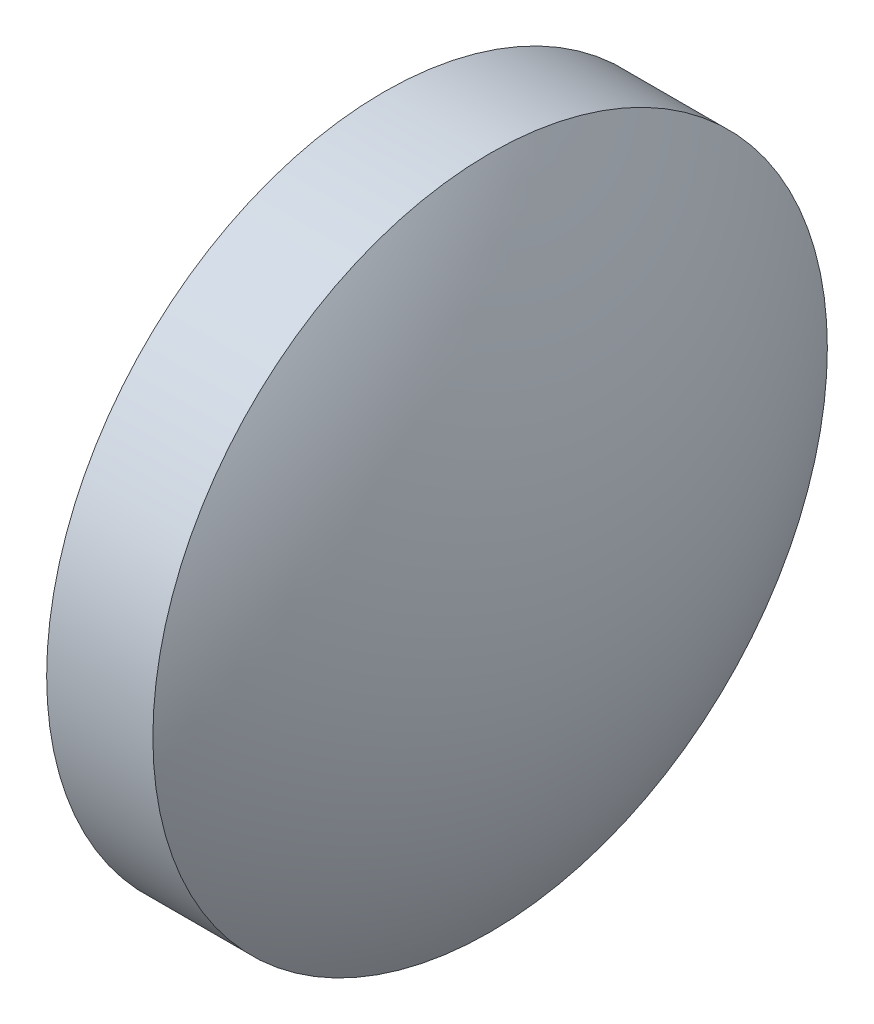
ISO-10303-21;
HEADER;
FILE_DESCRIPTION(('STEP AP214'),'2;1');
FILE_NAME('part.step','',(''),(''),'','','');
FILE_SCHEMA(('AUTOMOTIVE_DESIGN { 1 0 10303 214 1 1 1 1 }'));
ENDSEC;
DATA;
#1=APPLICATION_CONTEXT('core data for automotive mechanical design processes');
#2=APPLICATION_PROTOCOL_DEFINITION('international standard','automotive_design',2000,#1);
#3=PRODUCT_CONTEXT('',#1,'mechanical');
#4=PRODUCT('Part','Part','',(#3));
#5=PRODUCT_RELATED_PRODUCT_CATEGORY('part','',(#4));
#6=PRODUCT_DEFINITION_FORMATION('','',#4);
#7=PRODUCT_DEFINITION_CONTEXT('part definition',#1,'design');
#8=PRODUCT_DEFINITION('design','',#6,#7);
#9=PRODUCT_DEFINITION_SHAPE('','',#8);
#10=(LENGTH_UNIT() NAMED_UNIT(*) SI_UNIT(.MILLI.,.METRE.));
#11=(NAMED_UNIT(*) PLANE_ANGLE_UNIT() SI_UNIT($,.RADIAN.));
#12=(NAMED_UNIT(*) SI_UNIT($,.STERADIAN.) SOLID_ANGLE_UNIT());
#13=UNCERTAINTY_MEASURE_WITH_UNIT(LENGTH_MEASURE(1.E-05),#10,'distance_accuracy_value','');
#14=(GEOMETRIC_REPRESENTATION_CONTEXT(3) GLOBAL_UNCERTAINTY_ASSIGNED_CONTEXT((#13)) GLOBAL_UNIT_ASSIGNED_CONTEXT((#10,
#11,#12)) REPRESENTATION_CONTEXT('',''));
#15=CARTESIAN_POINT('',(0.,0.,0.));
#16=DIRECTION('',(0.,0.,1.));
#17=DIRECTION('',(1.,0.,0.));
#18=AXIS2_PLACEMENT_3D('',#15,#16,#17);
#19=CARTESIAN_POINT('',(52.5300739766944,24.3080565115924,0.));
#20=DIRECTION('',(-1.,0.,0.));
#21=DIRECTION('',(0.,1.,0.));
#22=AXIS2_PLACEMENT_3D('',#19,#20,#21);
#23=SPHERICAL_SURFACE('',#22,12.1009642322203);
#24=CARTESIAN_POINT('',(42.229062601617,24.3080565115924,0.));
#25=DIRECTION('',(-1.,0.,0.));
#26=DIRECTION('',(0.,0.,1.));
#27=AXIS2_PLACEMENT_3D('',#24,#25,#26);
#28=CIRCLE('',#27,6.35);
#29=CARTESIAN_POINT('',(42.229062601617,24.3080565115924,6.35));
#30=VERTEX_POINT('',#29);
#31=EDGE_CURVE('E46',#30,#30,#28,.T.);
#32=ORIENTED_EDGE('',*,*,#31,.T.);
#33=EDGE_LOOP('',(#32));
#34=FACE_BOUND('',#33,.T.);
#35=ADVANCED_FACE('F39',(#34),#23,.T.);
#36=CARTESIAN_POINT('',(33.9281197979682,24.3080565115924,0.));
#37=DIRECTION('',(-1.,0.,0.));
#38=DIRECTION('',(0.,-1.,0.));
#39=AXIS2_PLACEMENT_3D('',#36,#37,#38);
#40=SPHERICAL_SURFACE('',#39,12.1009642322203);
#41=CARTESIAN_POINT('',(44.2291311730456,24.3080565115924,0.));
#42=DIRECTION('',(-1.,0.,0.));
#43=DIRECTION('',(0.,0.,1.));
#44=AXIS2_PLACEMENT_3D('',#41,#42,#43);
#45=CIRCLE('',#44,6.35);
#46=CARTESIAN_POINT('',(44.2291311730456,24.3080565115924,6.35));
#47=VERTEX_POINT('',#46);
#48=EDGE_CURVE('E10',#47,#47,#45,.T.);
#49=ORIENTED_EDGE('',*,*,#48,.F.);
#50=EDGE_LOOP('',(#49));
#51=FACE_BOUND('',#50,.T.);
#52=ADVANCED_FACE('F56',(#51),#40,.T.);
#53=CARTESIAN_POINT('',(39.6527006754186,24.3080565115924,0.));
#54=DIRECTION('',(-1.,0.,0.));
#55=DIRECTION('',(0.,0.,1.));
#56=AXIS2_PLACEMENT_3D('',#53,#54,#55);
#57=CYLINDRICAL_SURFACE('',#56,6.35);
#58=ORIENTED_EDGE('',*,*,#48,.T.);
#59=EDGE_LOOP('',(#58));
#60=FACE_BOUND('',#59,.T.);
#61=ORIENTED_EDGE('',*,*,#31,.F.);
#62=EDGE_LOOP('',(#61));
#63=FACE_BOUND('',#62,.T.);
#64=ADVANCED_FACE('F54',(#60,#63),#57,.T.);
#65=CLOSED_SHELL('',(#35,#52,#64));
#66=MANIFOLD_SOLID_BREP('B2',#65);
#67=ADVANCED_BREP_SHAPE_REPRESENTATION('',(#18,#66),#14);
#68=SHAPE_DEFINITION_REPRESENTATION(#9,#67);
ENDSEC;
END-ISO-10303-21;
